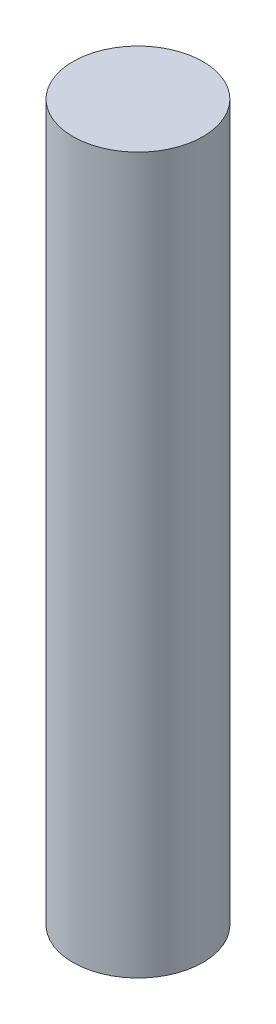
ISO-10303-21;
HEADER;
FILE_DESCRIPTION(('STEP AP214'),'2;1');
FILE_NAME('part.step','',(''),(''),'','','');
FILE_SCHEMA(('AUTOMOTIVE_DESIGN { 1 0 10303 214 1 1 1 1 }'));
ENDSEC;
DATA;
#1=APPLICATION_CONTEXT('core data for automotive mechanical design processes');
#2=APPLICATION_PROTOCOL_DEFINITION('international standard','automotive_design',2000,#1);
#3=PRODUCT_CONTEXT('',#1,'mechanical');
#4=PRODUCT('Part','Part','',(#3));
#5=PRODUCT_RELATED_PRODUCT_CATEGORY('part','',(#4));
#6=PRODUCT_DEFINITION_FORMATION('','',#4);
#7=PRODUCT_DEFINITION_CONTEXT('part definition',#1,'design');
#8=PRODUCT_DEFINITION('design','',#6,#7);
#9=PRODUCT_DEFINITION_SHAPE('','',#8);
#10=(LENGTH_UNIT() NAMED_UNIT(*) SI_UNIT(.MILLI.,.METRE.));
#11=(NAMED_UNIT(*) PLANE_ANGLE_UNIT() SI_UNIT($,.RADIAN.));
#12=(NAMED_UNIT(*) SI_UNIT($,.STERADIAN.) SOLID_ANGLE_UNIT());
#13=UNCERTAINTY_MEASURE_WITH_UNIT(LENGTH_MEASURE(1.E-05),#10,'distance_accuracy_value','');
#14=(GEOMETRIC_REPRESENTATION_CONTEXT(3) GLOBAL_UNCERTAINTY_ASSIGNED_CONTEXT((#13)) GLOBAL_UNIT_ASSIGNED_CONTEXT((#10,
#11,#12)) REPRESENTATION_CONTEXT('',''));
#15=CARTESIAN_POINT('',(0.,0.,0.));
#16=DIRECTION('',(0.,0.,1.));
#17=DIRECTION('',(1.,0.,0.));
#18=AXIS2_PLACEMENT_3D('',#15,#16,#17);
#19=CARTESIAN_POINT('',(0.,110.,0.));
#20=DIRECTION('',(0.,-1.,0.));
#21=DIRECTION('',(0.,0.,-1.));
#22=AXIS2_PLACEMENT_3D('',#19,#20,#21);
#23=CYLINDRICAL_SURFACE('',#22,10.);
#24=CARTESIAN_POINT('',(0.,110.,0.));
#25=DIRECTION('',(0.,1.,0.));
#26=DIRECTION('',(0.,0.,1.));
#27=AXIS2_PLACEMENT_3D('',#24,#25,#26);
#28=CIRCLE('',#27,10.);
#29=CARTESIAN_POINT('',(0.,110.,10.));
#30=VERTEX_POINT('',#29);
#31=EDGE_CURVE('E10',#30,#30,#28,.T.);
#32=ORIENTED_EDGE('',*,*,#31,.F.);
#33=EDGE_LOOP('',(#32));
#34=FACE_BOUND('',#33,.T.);
#35=CARTESIAN_POINT('',(0.,0.,0.));
#36=DIRECTION('',(0.,1.,0.));
#37=DIRECTION('',(0.,0.,1.));
#38=AXIS2_PLACEMENT_3D('',#35,#36,#37);
#39=CIRCLE('',#38,10.);
#40=CARTESIAN_POINT('',(0.,0.,10.));
#41=VERTEX_POINT('',#40);
#42=EDGE_CURVE('E38',#41,#41,#39,.T.);
#43=ORIENTED_EDGE('',*,*,#42,.T.);
#44=EDGE_LOOP('',(#43));
#45=FACE_BOUND('',#44,.T.);
#46=ADVANCED_FACE('F35',(#34,#45),#23,.T.);
#47=CARTESIAN_POINT('',(0.,110.,0.));
#48=DIRECTION('',(0.,1.,0.));
#49=DIRECTION('',(0.,0.,1.));
#50=AXIS2_PLACEMENT_3D('',#47,#48,#49);
#51=PLANE('',#50);
#52=ORIENTED_EDGE('',*,*,#31,.T.);
#53=EDGE_LOOP('',(#52));
#54=FACE_BOUND('',#53,.T.);
#55=ADVANCED_FACE('F50',(#54),#51,.T.);
#56=CARTESIAN_POINT('',(0.,0.,0.));
#57=DIRECTION('',(0.,1.,0.));
#58=DIRECTION('',(0.,0.,1.));
#59=AXIS2_PLACEMENT_3D('',#56,#57,#58);
#60=PLANE('',#59);
#61=ORIENTED_EDGE('',*,*,#42,.F.);
#62=EDGE_LOOP('',(#61));
#63=FACE_BOUND('',#62,.T.);
#64=ADVANCED_FACE('F48',(#63),#60,.F.);
#65=CLOSED_SHELL('',(#46,#55,#64));
#66=MANIFOLD_SOLID_BREP('B2',#65);
#67=ADVANCED_BREP_SHAPE_REPRESENTATION('',(#18,#66),#14);
#68=SHAPE_DEFINITION_REPRESENTATION(#9,#67);
ENDSEC;
END-ISO-10303-21;
